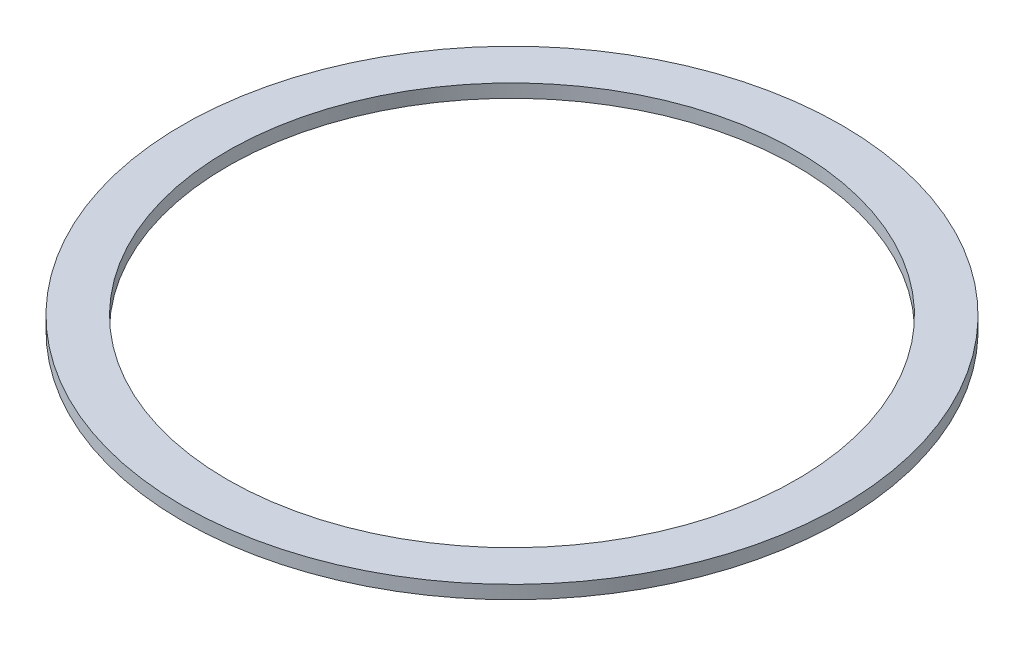
ISO-10303-21;
HEADER;
FILE_DESCRIPTION(('STEP AP214'),'2;1');
FILE_NAME('part.step','',(''),(''),'','','');
FILE_SCHEMA(('AUTOMOTIVE_DESIGN { 1 0 10303 214 1 1 1 1 }'));
ENDSEC;
DATA;
#1=APPLICATION_CONTEXT('core data for automotive mechanical design processes');
#2=APPLICATION_PROTOCOL_DEFINITION('international standard','automotive_design',2000,#1);
#3=PRODUCT_CONTEXT('',#1,'mechanical');
#4=PRODUCT('Part','Part','',(#3));
#5=PRODUCT_RELATED_PRODUCT_CATEGORY('part','',(#4));
#6=PRODUCT_DEFINITION_FORMATION('','',#4);
#7=PRODUCT_DEFINITION_CONTEXT('part definition',#1,'design');
#8=PRODUCT_DEFINITION('design','',#6,#7);
#9=PRODUCT_DEFINITION_SHAPE('','',#8);
#10=(LENGTH_UNIT() NAMED_UNIT(*) SI_UNIT(.MILLI.,.METRE.));
#11=(NAMED_UNIT(*) PLANE_ANGLE_UNIT() SI_UNIT($,.RADIAN.));
#12=(NAMED_UNIT(*) SI_UNIT($,.STERADIAN.) SOLID_ANGLE_UNIT());
#13=UNCERTAINTY_MEASURE_WITH_UNIT(LENGTH_MEASURE(1.E-05),#10,'distance_accuracy_value','');
#14=(GEOMETRIC_REPRESENTATION_CONTEXT(3) GLOBAL_UNCERTAINTY_ASSIGNED_CONTEXT((#13)) GLOBAL_UNIT_ASSIGNED_CONTEXT((#10,
#11,#12)) REPRESENTATION_CONTEXT('',''));
#15=CARTESIAN_POINT('',(0.,0.,0.));
#16=DIRECTION('',(0.,0.,1.));
#17=DIRECTION('',(1.,0.,0.));
#18=AXIS2_PLACEMENT_3D('',#15,#16,#17);
#19=CARTESIAN_POINT('',(0.,4.,0.));
#20=DIRECTION('',(0.,1.,0.));
#21=DIRECTION('',(0.,0.,1.));
#22=AXIS2_PLACEMENT_3D('',#19,#20,#21);
#23=PLANE('',#22);
#24=CARTESIAN_POINT('',(0.,4.,0.));
#25=DIRECTION('',(0.,1.,0.));
#26=DIRECTION('',(0.,0.,1.));
#27=AXIS2_PLACEMENT_3D('',#24,#25,#26);
#28=CIRCLE('',#27,99.);
#29=CARTESIAN_POINT('',(0.,4.,99.));
#30=VERTEX_POINT('',#29);
#31=EDGE_CURVE('E10',#30,#30,#28,.T.);
#32=ORIENTED_EDGE('',*,*,#31,.T.);
#33=EDGE_LOOP('',(#32));
#34=FACE_BOUND('',#33,.T.);
#35=CARTESIAN_POINT('',(0.,4.,0.));
#36=DIRECTION('',(0.,1.,0.));
#37=DIRECTION('',(0.,0.,1.));
#38=AXIS2_PLACEMENT_3D('',#35,#36,#37);
#39=CIRCLE('',#38,85.5);
#40=CARTESIAN_POINT('',(0.,4.,85.5));
#41=VERTEX_POINT('',#40);
#42=EDGE_CURVE('E42',#41,#41,#39,.T.);
#43=ORIENTED_EDGE('',*,*,#42,.F.);
#44=EDGE_LOOP('',(#43));
#45=FACE_BOUND('',#44,.T.);
#46=ADVANCED_FACE('F31',(#34,#45),#23,.T.);
#47=CARTESIAN_POINT('',(0.,0.,0.));
#48=DIRECTION('',(0.,1.,0.));
#49=DIRECTION('',(0.,0.,1.));
#50=AXIS2_PLACEMENT_3D('',#47,#48,#49);
#51=PLANE('',#50);
#52=CARTESIAN_POINT('',(0.,0.,0.));
#53=DIRECTION('',(0.,1.,0.));
#54=DIRECTION('',(0.,0.,1.));
#55=AXIS2_PLACEMENT_3D('',#52,#53,#54);
#56=CIRCLE('',#55,99.);
#57=CARTESIAN_POINT('',(0.,0.,99.));
#58=VERTEX_POINT('',#57);
#59=EDGE_CURVE('E35',#58,#58,#56,.T.);
#60=ORIENTED_EDGE('',*,*,#59,.F.);
#61=EDGE_LOOP('',(#60));
#62=FACE_BOUND('',#61,.T.);
#63=CARTESIAN_POINT('',(0.,0.,0.));
#64=DIRECTION('',(0.,1.,0.));
#65=DIRECTION('',(0.,0.,1.));
#66=AXIS2_PLACEMENT_3D('',#63,#64,#65);
#67=CIRCLE('',#66,85.5);
#68=CARTESIAN_POINT('',(0.,0.,85.5));
#69=VERTEX_POINT('',#68);
#70=EDGE_CURVE('E44',#69,#69,#67,.T.);
#71=ORIENTED_EDGE('',*,*,#70,.T.);
#72=EDGE_LOOP('',(#71));
#73=FACE_BOUND('',#72,.T.);
#74=ADVANCED_FACE('F54',(#62,#73),#51,.F.);
#75=CARTESIAN_POINT('',(0.,4.,0.));
#76=DIRECTION('',(0.,-1.,0.));
#77=DIRECTION('',(0.,0.,-1.));
#78=AXIS2_PLACEMENT_3D('',#75,#76,#77);
#79=CYLINDRICAL_SURFACE('',#78,99.);
#80=ORIENTED_EDGE('',*,*,#31,.F.);
#81=EDGE_LOOP('',(#80));
#82=FACE_BOUND('',#81,.T.);
#83=ORIENTED_EDGE('',*,*,#59,.T.);
#84=EDGE_LOOP('',(#83));
#85=FACE_BOUND('',#84,.T.);
#86=ADVANCED_FACE('F33',(#82,#85),#79,.T.);
#87=CARTESIAN_POINT('',(0.,4.,0.));
#88=DIRECTION('',(0.,-1.,0.));
#89=DIRECTION('',(0.,0.,-1.));
#90=AXIS2_PLACEMENT_3D('',#87,#88,#89);
#91=CYLINDRICAL_SURFACE('',#90,85.5);
#92=ORIENTED_EDGE('',*,*,#42,.T.);
#93=EDGE_LOOP('',(#92));
#94=FACE_BOUND('',#93,.T.);
#95=ORIENTED_EDGE('',*,*,#70,.F.);
#96=EDGE_LOOP('',(#95));
#97=FACE_BOUND('',#96,.T.);
#98=ADVANCED_FACE('F50',(#94,#97),#91,.F.);
#99=CLOSED_SHELL('',(#46,#74,#86,#98));
#100=MANIFOLD_SOLID_BREP('B2',#99);
#101=ADVANCED_BREP_SHAPE_REPRESENTATION('',(#18,#100),#14);
#102=SHAPE_DEFINITION_REPRESENTATION(#9,#101);
ENDSEC;
END-ISO-10303-21;
